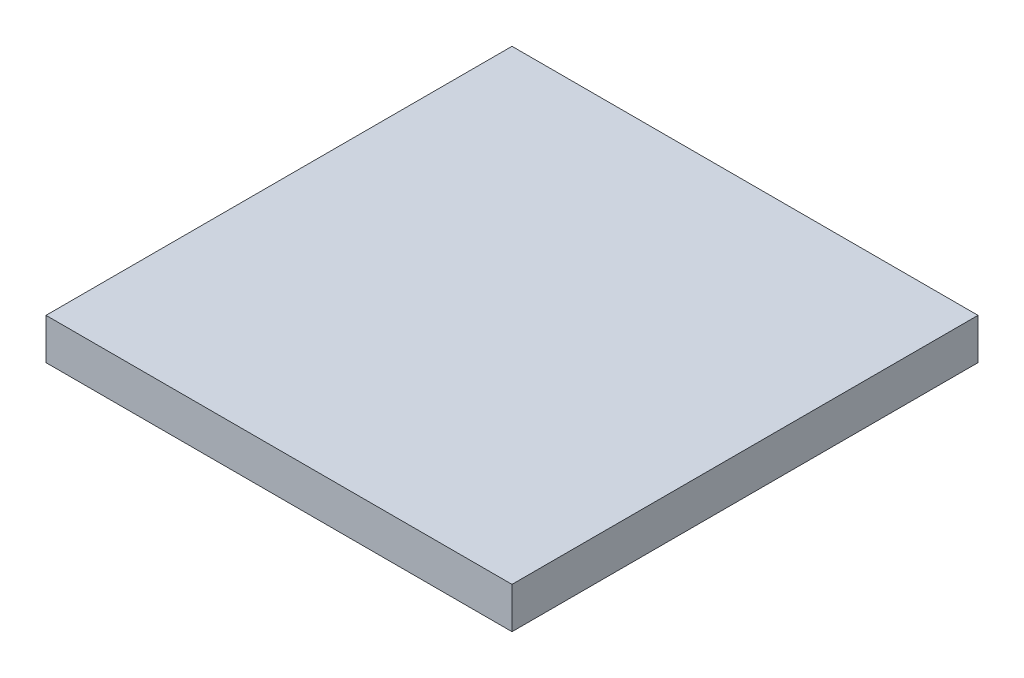
ISO-10303-21;
HEADER;
FILE_DESCRIPTION(('STEP AP214'),'2;1');
FILE_NAME('part.step','',(''),(''),'','','');
FILE_SCHEMA(('AUTOMOTIVE_DESIGN { 1 0 10303 214 1 1 1 1 }'));
ENDSEC;
DATA;
#1=APPLICATION_CONTEXT('core data for automotive mechanical design processes');
#2=APPLICATION_PROTOCOL_DEFINITION('international standard','automotive_design',2000,#1);
#3=PRODUCT_CONTEXT('',#1,'mechanical');
#4=PRODUCT('Part','Part','',(#3));
#5=PRODUCT_RELATED_PRODUCT_CATEGORY('part','',(#4));
#6=PRODUCT_DEFINITION_FORMATION('','',#4);
#7=PRODUCT_DEFINITION_CONTEXT('part definition',#1,'design');
#8=PRODUCT_DEFINITION('design','',#6,#7);
#9=PRODUCT_DEFINITION_SHAPE('','',#8);
#10=(LENGTH_UNIT() NAMED_UNIT(*) SI_UNIT(.MILLI.,.METRE.));
#11=(NAMED_UNIT(*) PLANE_ANGLE_UNIT() SI_UNIT($,.RADIAN.));
#12=(NAMED_UNIT(*) SI_UNIT($,.STERADIAN.) SOLID_ANGLE_UNIT());
#13=UNCERTAINTY_MEASURE_WITH_UNIT(LENGTH_MEASURE(1.E-05),#10,'distance_accuracy_value','');
#14=(GEOMETRIC_REPRESENTATION_CONTEXT(3) GLOBAL_UNCERTAINTY_ASSIGNED_CONTEXT((#13)) GLOBAL_UNIT_ASSIGNED_CONTEXT((#10,
#11,#12)) REPRESENTATION_CONTEXT('',''));
#15=CARTESIAN_POINT('',(0.,0.,0.));
#16=DIRECTION('',(0.,0.,1.));
#17=DIRECTION('',(1.,0.,0.));
#18=AXIS2_PLACEMENT_3D('',#15,#16,#17);
#19=CARTESIAN_POINT('',(6.25,1.1,-6.25));
#20=DIRECTION('',(-1.,0.,0.));
#21=DIRECTION('',(0.,0.,1.));
#22=AXIS2_PLACEMENT_3D('',#19,#20,#21);
#23=PLANE('',#22);
#24=DIRECTION('',(0.,0.,-1.));
#25=VECTOR('',#24,1.);
#26=CARTESIAN_POINT('',(6.25,0.,-6.25));
#27=LINE('',#26,#25);
#28=CARTESIAN_POINT('',(6.25,0.,6.25));
#29=VERTEX_POINT('',#28);
#30=CARTESIAN_POINT('',(6.25,0.,-6.25));
#31=VERTEX_POINT('',#30);
#32=EDGE_CURVE('E98',#29,#31,#27,.T.);
#33=ORIENTED_EDGE('',*,*,#32,.T.);
#34=DIRECTION('',(0.,-1.,0.));
#35=VECTOR('',#34,1.);
#36=CARTESIAN_POINT('',(6.25,1.1,-6.25));
#37=LINE('',#36,#35);
#38=CARTESIAN_POINT('',(6.25,1.1,-6.25));
#39=VERTEX_POINT('',#38);
#40=EDGE_CURVE('E11',#39,#31,#37,.T.);
#41=ORIENTED_EDGE('',*,*,#40,.F.);
#42=DIRECTION('',(0.,0.,-1.));
#43=VECTOR('',#42,1.);
#44=CARTESIAN_POINT('',(6.25,1.1,-6.25));
#45=LINE('',#44,#43);
#46=CARTESIAN_POINT('',(6.25,1.1,6.25));
#47=VERTEX_POINT('',#46);
#48=EDGE_CURVE('E86',#47,#39,#45,.T.);
#49=ORIENTED_EDGE('',*,*,#48,.F.);
#50=DIRECTION('',(0.,-1.,0.));
#51=VECTOR('',#50,1.);
#52=CARTESIAN_POINT('',(6.25,1.1,6.25));
#53=LINE('',#52,#51);
#54=EDGE_CURVE('E94',#47,#29,#53,.T.);
#55=ORIENTED_EDGE('',*,*,#54,.T.);
#56=EDGE_LOOP('',(#33,#41,#49,#55));
#57=FACE_BOUND('',#56,.T.);
#58=ADVANCED_FACE('F35',(#57),#23,.F.);
#59=CARTESIAN_POINT('',(-6.25,1.1,-6.25));
#60=DIRECTION('',(0.,0.,1.));
#61=DIRECTION('',(1.,0.,0.));
#62=AXIS2_PLACEMENT_3D('',#59,#60,#61);
#63=PLANE('',#62);
#64=DIRECTION('',(-1.,0.,0.));
#65=VECTOR('',#64,1.);
#66=CARTESIAN_POINT('',(-6.25,0.,-6.25));
#67=LINE('',#66,#65);
#68=CARTESIAN_POINT('',(-6.25,0.,-6.25));
#69=VERTEX_POINT('',#68);
#70=EDGE_CURVE('E90',#31,#69,#67,.T.);
#71=ORIENTED_EDGE('',*,*,#70,.T.);
#72=DIRECTION('',(0.,-1.,0.));
#73=VECTOR('',#72,1.);
#74=CARTESIAN_POINT('',(-6.25,1.1,-6.25));
#75=LINE('',#74,#73);
#76=CARTESIAN_POINT('',(-6.25,1.1,-6.25));
#77=VERTEX_POINT('',#76);
#78=EDGE_CURVE('E43',#77,#69,#75,.T.);
#79=ORIENTED_EDGE('',*,*,#78,.F.);
#80=DIRECTION('',(-1.,0.,0.));
#81=VECTOR('',#80,1.);
#82=CARTESIAN_POINT('',(-6.25,1.1,-6.25));
#83=LINE('',#82,#81);
#84=EDGE_CURVE('E81',#39,#77,#83,.T.);
#85=ORIENTED_EDGE('',*,*,#84,.F.);
#86=ORIENTED_EDGE('',*,*,#40,.T.);
#87=EDGE_LOOP('',(#71,#79,#85,#86));
#88=FACE_BOUND('',#87,.T.);
#89=ADVANCED_FACE('F89',(#88),#63,.F.);
#90=CARTESIAN_POINT('',(-6.25,1.1,-6.25));
#91=DIRECTION('',(1.,0.,0.));
#92=DIRECTION('',(0.,0.,-1.));
#93=AXIS2_PLACEMENT_3D('',#90,#91,#92);
#94=PLANE('',#93);
#95=DIRECTION('',(0.,0.,1.));
#96=VECTOR('',#95,1.);
#97=CARTESIAN_POINT('',(-6.25,0.,-6.25));
#98=LINE('',#97,#96);
#99=CARTESIAN_POINT('',(-6.25,0.,6.25));
#100=VERTEX_POINT('',#99);
#101=EDGE_CURVE('E68',#69,#100,#98,.T.);
#102=ORIENTED_EDGE('',*,*,#101,.T.);
#103=DIRECTION('',(0.,-1.,0.));
#104=VECTOR('',#103,1.);
#105=CARTESIAN_POINT('',(-6.25,1.1,6.25));
#106=LINE('',#105,#104);
#107=CARTESIAN_POINT('',(-6.25,1.1,6.25));
#108=VERTEX_POINT('',#107);
#109=EDGE_CURVE('E91',#108,#100,#106,.T.);
#110=ORIENTED_EDGE('',*,*,#109,.F.);
#111=DIRECTION('',(0.,0.,1.));
#112=VECTOR('',#111,1.);
#113=CARTESIAN_POINT('',(-6.25,1.1,-6.25));
#114=LINE('',#113,#112);
#115=EDGE_CURVE('E84',#77,#108,#114,.T.);
#116=ORIENTED_EDGE('',*,*,#115,.F.);
#117=ORIENTED_EDGE('',*,*,#78,.T.);
#118=EDGE_LOOP('',(#102,#110,#116,#117));
#119=FACE_BOUND('',#118,.T.);
#120=ADVANCED_FACE('F92',(#119),#94,.F.);
#121=CARTESIAN_POINT('',(-6.25,1.1,6.25));
#122=DIRECTION('',(0.,0.,-1.));
#123=DIRECTION('',(-1.,0.,0.));
#124=AXIS2_PLACEMENT_3D('',#121,#122,#123);
#125=PLANE('',#124);
#126=DIRECTION('',(1.,0.,0.));
#127=VECTOR('',#126,1.);
#128=CARTESIAN_POINT('',(-6.25,0.,6.25));
#129=LINE('',#128,#127);
#130=EDGE_CURVE('E74',#100,#29,#129,.T.);
#131=ORIENTED_EDGE('',*,*,#130,.T.);
#132=ORIENTED_EDGE('',*,*,#54,.F.);
#133=DIRECTION('',(1.,0.,0.));
#134=VECTOR('',#133,1.);
#135=CARTESIAN_POINT('',(-6.25,1.1,6.25));
#136=LINE('',#135,#134);
#137=EDGE_CURVE('E51',#108,#47,#136,.T.);
#138=ORIENTED_EDGE('',*,*,#137,.F.);
#139=ORIENTED_EDGE('',*,*,#109,.T.);
#140=EDGE_LOOP('',(#131,#132,#138,#139));
#141=FACE_BOUND('',#140,.T.);
#142=ADVANCED_FACE('F105',(#141),#125,.F.);
#143=CARTESIAN_POINT('',(0.,1.1,0.));
#144=DIRECTION('',(0.,1.,0.));
#145=DIRECTION('',(0.,0.,1.));
#146=AXIS2_PLACEMENT_3D('',#143,#144,#145);
#147=PLANE('',#146);
#148=ORIENTED_EDGE('',*,*,#48,.T.);
#149=ORIENTED_EDGE('',*,*,#84,.T.);
#150=ORIENTED_EDGE('',*,*,#115,.T.);
#151=ORIENTED_EDGE('',*,*,#137,.T.);
#152=EDGE_LOOP('',(#148,#149,#150,#151));
#153=FACE_BOUND('',#152,.T.);
#154=ADVANCED_FACE('F82',(#153),#147,.T.);
#155=CARTESIAN_POINT('',(0.,0.,0.));
#156=DIRECTION('',(0.,1.,0.));
#157=DIRECTION('',(0.,0.,1.));
#158=AXIS2_PLACEMENT_3D('',#155,#156,#157);
#159=PLANE('',#158);
#160=ORIENTED_EDGE('',*,*,#32,.F.);
#161=ORIENTED_EDGE('',*,*,#130,.F.);
#162=ORIENTED_EDGE('',*,*,#101,.F.);
#163=ORIENTED_EDGE('',*,*,#70,.F.);
#164=EDGE_LOOP('',(#160,#161,#162,#163));
#165=FACE_BOUND('',#164,.T.);
#166=ADVANCED_FACE('F108',(#165),#159,.F.);
#167=CLOSED_SHELL('',(#58,#89,#120,#142,#154,#166));
#168=MANIFOLD_SOLID_BREP('B2',#167);
#169=ADVANCED_BREP_SHAPE_REPRESENTATION('',(#18,#168),#14);
#170=SHAPE_DEFINITION_REPRESENTATION(#9,#169);
ENDSEC;
END-ISO-10303-21;
